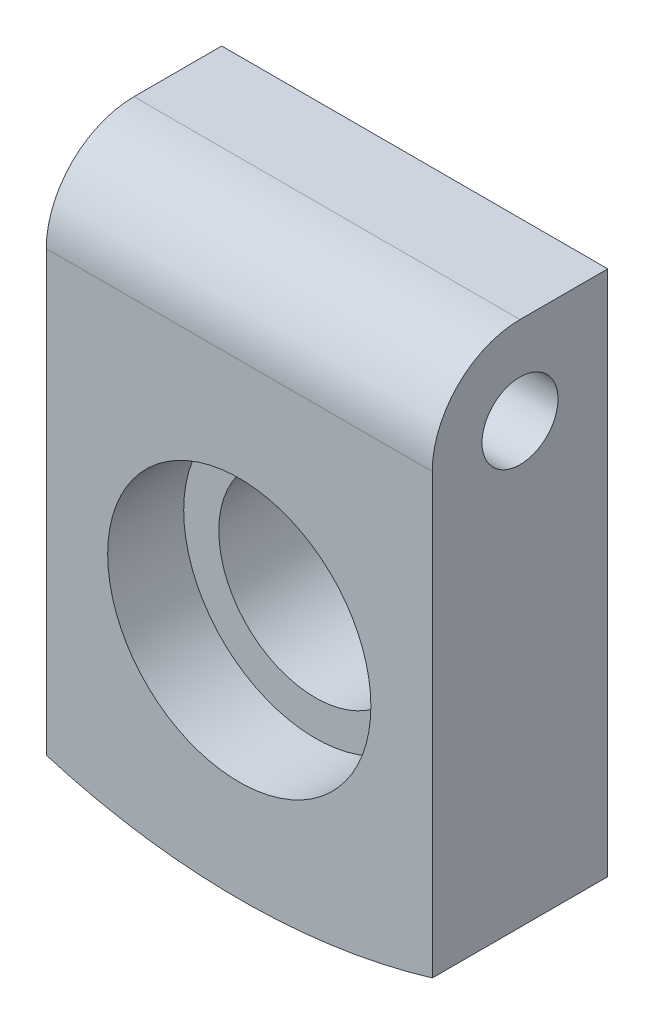
ISO-10303-21;
HEADER;
FILE_DESCRIPTION(('STEP AP214'),'2;1');
FILE_NAME('part.step','',(''),(''),'','','');
FILE_SCHEMA(('AUTOMOTIVE_DESIGN { 1 0 10303 214 1 1 1 1 }'));
ENDSEC;
DATA;
#1=APPLICATION_CONTEXT('core data for automotive mechanical design processes');
#2=APPLICATION_PROTOCOL_DEFINITION('international standard','automotive_design',2000,#1);
#3=PRODUCT_CONTEXT('',#1,'mechanical');
#4=PRODUCT('Part','Part','',(#3));
#5=PRODUCT_RELATED_PRODUCT_CATEGORY('part','',(#4));
#6=PRODUCT_DEFINITION_FORMATION('','',#4);
#7=PRODUCT_DEFINITION_CONTEXT('part definition',#1,'design');
#8=PRODUCT_DEFINITION('design','',#6,#7);
#9=PRODUCT_DEFINITION_SHAPE('','',#8);
#10=(LENGTH_UNIT() NAMED_UNIT(*) SI_UNIT(.MILLI.,.METRE.));
#11=(NAMED_UNIT(*) PLANE_ANGLE_UNIT() SI_UNIT($,.RADIAN.));
#12=(NAMED_UNIT(*) SI_UNIT($,.STERADIAN.) SOLID_ANGLE_UNIT());
#13=UNCERTAINTY_MEASURE_WITH_UNIT(LENGTH_MEASURE(1.E-05),#10,'distance_accuracy_value','');
#14=(GEOMETRIC_REPRESENTATION_CONTEXT(3) GLOBAL_UNCERTAINTY_ASSIGNED_CONTEXT((#13)) GLOBAL_UNIT_ASSIGNED_CONTEXT((#10,
#11,#12)) REPRESENTATION_CONTEXT('',''));
#15=CARTESIAN_POINT('',(0.,0.,0.));
#16=DIRECTION('',(0.,0.,1.));
#17=DIRECTION('',(1.,0.,0.));
#18=AXIS2_PLACEMENT_3D('',#15,#16,#17);
#19=CARTESIAN_POINT('',(33.,110.163514831363,30.));
#20=DIRECTION('',(0.,0.,-1.));
#21=DIRECTION('',(-1.,0.,0.));
#22=AXIS2_PLACEMENT_3D('',#19,#20,#21);
#23=CYLINDRICAL_SURFACE('',#22,115.);
#24=CARTESIAN_POINT('',(33.,110.163514831363,0.));
#25=DIRECTION('',(0.,0.,1.));
#26=DIRECTION('',(1.,0.,0.));
#27=AXIS2_PLACEMENT_3D('',#24,#25,#26);
#28=CIRCLE('',#27,115.);
#29=CARTESIAN_POINT('',(0.,0.,0.));
#30=VERTEX_POINT('',#29);
#31=CARTESIAN_POINT('',(66.,0.,0.));
#32=VERTEX_POINT('',#31);
#33=EDGE_CURVE('E104',#30,#32,#28,.T.);
#34=ORIENTED_EDGE('',*,*,#33,.T.);
#35=DIRECTION('',(0.,0.,-1.));
#36=VECTOR('',#35,1.);
#37=CARTESIAN_POINT('',(66.,0.,30.));
#38=LINE('',#37,#36);
#39=CARTESIAN_POINT('',(66.,0.,30.));
#40=VERTEX_POINT('',#39);
#41=EDGE_CURVE('E87',#40,#32,#38,.T.);
#42=ORIENTED_EDGE('',*,*,#41,.F.);
#43=CARTESIAN_POINT('',(33.,110.163514831363,30.));
#44=DIRECTION('',(0.,0.,1.));
#45=DIRECTION('',(1.,0.,0.));
#46=AXIS2_PLACEMENT_3D('',#43,#44,#45);
#47=CIRCLE('',#46,115.);
#48=CARTESIAN_POINT('',(0.,0.,30.));
#49=VERTEX_POINT('',#48);
#50=EDGE_CURVE('E94',#49,#40,#47,.T.);
#51=ORIENTED_EDGE('',*,*,#50,.F.);
#52=DIRECTION('',(0.,0.,-1.));
#53=VECTOR('',#52,1.);
#54=CARTESIAN_POINT('',(0.,0.,30.));
#55=LINE('',#54,#53);
#56=EDGE_CURVE('E114',#49,#30,#55,.T.);
#57=ORIENTED_EDGE('',*,*,#56,.T.);
#58=EDGE_LOOP('',(#34,#42,#51,#57));
#59=FACE_BOUND('',#58,.T.);
#60=ADVANCED_FACE('F37',(#59),#23,.T.);
#61=CARTESIAN_POINT('',(66.,90.,30.));
#62=DIRECTION('',(-1.,0.,0.));
#63=DIRECTION('',(0.,-1.,0.));
#64=AXIS2_PLACEMENT_3D('',#61,#62,#63);
#65=PLANE('',#64);
#66=CARTESIAN_POINT('',(66.,75.,15.));
#67=DIRECTION('',(-1.,0.,0.));
#68=DIRECTION('',(0.,-1.,0.));
#69=AXIS2_PLACEMENT_3D('',#66,#67,#68);
#70=CIRCLE('',#69,6.5);
#71=CARTESIAN_POINT('',(66.,68.5,15.));
#72=VERTEX_POINT('',#71);
#73=EDGE_CURVE('E134',#72,#72,#70,.F.);
#74=ORIENTED_EDGE('',*,*,#73,.F.);
#75=EDGE_LOOP('',(#74));
#76=FACE_BOUND('',#75,.T.);
#77=DIRECTION('',(0.,0.,-1.));
#78=VECTOR('',#77,1.);
#79=CARTESIAN_POINT('',(66.,90.,30.));
#80=LINE('',#79,#78);
#81=CARTESIAN_POINT('',(66.,90.,15.));
#82=VERTEX_POINT('',#81);
#83=CARTESIAN_POINT('',(66.,90.,0.));
#84=VERTEX_POINT('',#83);
#85=EDGE_CURVE('E106',#82,#84,#80,.T.);
#86=ORIENTED_EDGE('',*,*,#85,.F.);
#87=CARTESIAN_POINT('',(66.,75.,15.));
#88=DIRECTION('',(-1.,0.,0.));
#89=DIRECTION('',(0.,-1.,0.));
#90=AXIS2_PLACEMENT_3D('',#87,#88,#89);
#91=CIRCLE('',#90,15.);
#92=CARTESIAN_POINT('',(66.,75.,30.));
#93=VERTEX_POINT('',#92);
#94=EDGE_CURVE('E11',#82,#93,#91,.F.);
#95=ORIENTED_EDGE('',*,*,#94,.T.);
#96=DIRECTION('',(0.,1.,0.));
#97=VECTOR('',#96,1.);
#98=CARTESIAN_POINT('',(66.,90.,30.));
#99=LINE('',#98,#97);
#100=EDGE_CURVE('E82',#40,#93,#99,.T.);
#101=ORIENTED_EDGE('',*,*,#100,.F.);
#102=ORIENTED_EDGE('',*,*,#41,.T.);
#103=DIRECTION('',(0.,1.,0.));
#104=VECTOR('',#103,1.);
#105=CARTESIAN_POINT('',(66.,90.,0.));
#106=LINE('',#105,#104);
#107=EDGE_CURVE('E120',#32,#84,#106,.T.);
#108=ORIENTED_EDGE('',*,*,#107,.T.);
#109=EDGE_LOOP('',(#86,#95,#101,#102,#108));
#110=FACE_BOUND('',#109,.T.);
#111=ADVANCED_FACE('F84',(#76,#110),#65,.F.);
#112=CARTESIAN_POINT('',(0.,90.,30.));
#113=DIRECTION('',(0.,-1.,0.));
#114=DIRECTION('',(0.,0.,-1.));
#115=AXIS2_PLACEMENT_3D('',#112,#113,#114);
#116=PLANE('',#115);
#117=DIRECTION('',(0.,0.,-1.));
#118=VECTOR('',#117,1.);
#119=CARTESIAN_POINT('',(0.,90.,30.));
#120=LINE('',#119,#118);
#121=CARTESIAN_POINT('',(0.,90.,15.));
#122=VERTEX_POINT('',#121);
#123=CARTESIAN_POINT('',(0.,90.,0.));
#124=VERTEX_POINT('',#123);
#125=EDGE_CURVE('E109',#122,#124,#120,.T.);
#126=ORIENTED_EDGE('',*,*,#125,.F.);
#127=DIRECTION('',(-1.,0.,0.));
#128=VECTOR('',#127,1.);
#129=CARTESIAN_POINT('',(66.,90.,15.));
#130=LINE('',#129,#128);
#131=EDGE_CURVE('E45',#122,#82,#130,.F.);
#132=ORIENTED_EDGE('',*,*,#131,.T.);
#133=ORIENTED_EDGE('',*,*,#85,.T.);
#134=DIRECTION('',(-1.,0.,0.));
#135=VECTOR('',#134,1.);
#136=CARTESIAN_POINT('',(0.,90.,0.));
#137=LINE('',#136,#135);
#138=EDGE_CURVE('E117',#84,#124,#137,.T.);
#139=ORIENTED_EDGE('',*,*,#138,.T.);
#140=EDGE_LOOP('',(#126,#132,#133,#139));
#141=FACE_BOUND('',#140,.T.);
#142=ADVANCED_FACE('F148',(#141),#116,.F.);
#143=CARTESIAN_POINT('',(0.,0.,30.));
#144=DIRECTION('',(1.,0.,0.));
#145=DIRECTION('',(0.,0.,-1.));
#146=AXIS2_PLACEMENT_3D('',#143,#144,#145);
#147=PLANE('',#146);
#148=CARTESIAN_POINT('',(0.,75.,15.));
#149=DIRECTION('',(-1.,0.,0.));
#150=DIRECTION('',(0.,0.,1.));
#151=AXIS2_PLACEMENT_3D('',#148,#149,#150);
#152=CIRCLE('',#151,6.5);
#153=CARTESIAN_POINT('',(0.,75.,21.5));
#154=VERTEX_POINT('',#153);
#155=EDGE_CURVE('E139',#154,#154,#152,.T.);
#156=ORIENTED_EDGE('',*,*,#155,.F.);
#157=EDGE_LOOP('',(#156));
#158=FACE_BOUND('',#157,.T.);
#159=DIRECTION('',(0.,-1.,0.));
#160=VECTOR('',#159,1.);
#161=CARTESIAN_POINT('',(0.,0.,30.));
#162=LINE('',#161,#160);
#163=CARTESIAN_POINT('',(0.,75.,30.));
#164=VERTEX_POINT('',#163);
#165=EDGE_CURVE('E93',#164,#49,#162,.T.);
#166=ORIENTED_EDGE('',*,*,#165,.F.);
#167=CARTESIAN_POINT('',(0.,75.,15.));
#168=DIRECTION('',(1.,0.,0.));
#169=DIRECTION('',(0.,0.,-1.));
#170=AXIS2_PLACEMENT_3D('',#167,#168,#169);
#171=CIRCLE('',#170,15.);
#172=EDGE_CURVE('E59',#164,#122,#171,.F.);
#173=ORIENTED_EDGE('',*,*,#172,.T.);
#174=ORIENTED_EDGE('',*,*,#125,.T.);
#175=DIRECTION('',(0.,-1.,0.));
#176=VECTOR('',#175,1.);
#177=CARTESIAN_POINT('',(0.,0.,0.));
#178=LINE('',#177,#176);
#179=EDGE_CURVE('E101',#124,#30,#178,.T.);
#180=ORIENTED_EDGE('',*,*,#179,.T.);
#181=ORIENTED_EDGE('',*,*,#56,.F.);
#182=EDGE_LOOP('',(#166,#173,#174,#180,#181));
#183=FACE_BOUND('',#182,.T.);
#184=ADVANCED_FACE('F146',(#158,#183),#147,.F.);
#185=CARTESIAN_POINT('',(33.,110.163514831363,30.));
#186=DIRECTION('',(0.,0.,1.));
#187=DIRECTION('',(1.,0.,0.));
#188=AXIS2_PLACEMENT_3D('',#185,#186,#187);
#189=PLANE('',#188);
#190=CARTESIAN_POINT('',(33.,35.,30.));
#191=DIRECTION('',(0.,0.,1.));
#192=DIRECTION('',(1.,0.,0.));
#193=AXIS2_PLACEMENT_3D('',#190,#191,#192);
#194=CIRCLE('',#193,22.5);
#195=CARTESIAN_POINT('',(55.5,35.,30.));
#196=VERTEX_POINT('',#195);
#197=EDGE_CURVE('E131',#196,#196,#194,.F.);
#198=ORIENTED_EDGE('',*,*,#197,.T.);
#199=EDGE_LOOP('',(#198));
#200=FACE_BOUND('',#199,.T.);
#201=ORIENTED_EDGE('',*,*,#100,.T.);
#202=DIRECTION('',(-1.,0.,0.));
#203=VECTOR('',#202,1.);
#204=CARTESIAN_POINT('',(0.,75.,30.));
#205=LINE('',#204,#203);
#206=EDGE_CURVE('E105',#93,#164,#205,.T.);
#207=ORIENTED_EDGE('',*,*,#206,.T.);
#208=ORIENTED_EDGE('',*,*,#165,.T.);
#209=ORIENTED_EDGE('',*,*,#50,.T.);
#210=EDGE_LOOP('',(#201,#207,#208,#209));
#211=FACE_BOUND('',#210,.T.);
#212=ADVANCED_FACE('F97',(#200,#211),#189,.T.);
#213=CARTESIAN_POINT('',(33.,110.163514831363,0.));
#214=DIRECTION('',(0.,0.,1.));
#215=DIRECTION('',(1.,0.,0.));
#216=AXIS2_PLACEMENT_3D('',#213,#214,#215);
#217=PLANE('',#216);
#218=CARTESIAN_POINT('',(33.,35.,0.));
#219=DIRECTION('',(0.,0.,-1.));
#220=DIRECTION('',(-1.,0.,0.));
#221=AXIS2_PLACEMENT_3D('',#218,#219,#220);
#222=CIRCLE('',#221,16.5);
#223=CARTESIAN_POINT('',(16.5,35.,0.));
#224=VERTEX_POINT('',#223);
#225=EDGE_CURVE('E123',#224,#224,#222,.T.);
#226=ORIENTED_EDGE('',*,*,#225,.F.);
#227=EDGE_LOOP('',(#226));
#228=FACE_BOUND('',#227,.T.);
#229=ORIENTED_EDGE('',*,*,#33,.F.);
#230=ORIENTED_EDGE('',*,*,#179,.F.);
#231=ORIENTED_EDGE('',*,*,#138,.F.);
#232=ORIENTED_EDGE('',*,*,#107,.F.);
#233=EDGE_LOOP('',(#229,#230,#231,#232));
#234=FACE_BOUND('',#233,.T.);
#235=ADVANCED_FACE('F152',(#228,#234),#217,.F.);
#236=CARTESIAN_POINT('',(33.,35.,17.));
#237=DIRECTION('',(0.,0.,-1.));
#238=DIRECTION('',(-1.,0.,0.));
#239=AXIS2_PLACEMENT_3D('',#236,#237,#238);
#240=CYLINDRICAL_SURFACE('',#239,16.5);
#241=CARTESIAN_POINT('',(33.,35.,17.));
#242=DIRECTION('',(0.,0.,-1.));
#243=DIRECTION('',(-1.,0.,0.));
#244=AXIS2_PLACEMENT_3D('',#241,#242,#243);
#245=CIRCLE('',#244,16.5);
#246=CARTESIAN_POINT('',(16.5,35.,17.));
#247=VERTEX_POINT('',#246);
#248=EDGE_CURVE('E127',#247,#247,#245,.T.);
#249=ORIENTED_EDGE('',*,*,#248,.F.);
#250=EDGE_LOOP('',(#249));
#251=FACE_BOUND('',#250,.T.);
#252=ORIENTED_EDGE('',*,*,#225,.T.);
#253=EDGE_LOOP('',(#252));
#254=FACE_BOUND('',#253,.T.);
#255=ADVANCED_FACE('F176',(#251,#254),#240,.F.);
#256=CARTESIAN_POINT('',(33.,35.,30.001));
#257=DIRECTION('',(0.,0.,-1.));
#258=DIRECTION('',(-1.,0.,0.));
#259=AXIS2_PLACEMENT_3D('',#256,#257,#258);
#260=CYLINDRICAL_SURFACE('',#259,22.5);
#261=ORIENTED_EDGE('',*,*,#197,.F.);
#262=EDGE_LOOP('',(#261));
#263=FACE_BOUND('',#262,.T.);
#264=CARTESIAN_POINT('',(33.,35.,17.));
#265=DIRECTION('',(0.,0.,-1.));
#266=DIRECTION('',(-1.,0.,0.));
#267=AXIS2_PLACEMENT_3D('',#264,#265,#266);
#268=CIRCLE('',#267,22.5);
#269=CARTESIAN_POINT('',(10.5,35.,17.));
#270=VERTEX_POINT('',#269);
#271=EDGE_CURVE('E130',#270,#270,#268,.T.);
#272=ORIENTED_EDGE('',*,*,#271,.T.);
#273=EDGE_LOOP('',(#272));
#274=FACE_BOUND('',#273,.T.);
#275=ADVANCED_FACE('F162',(#263,#274),#260,.F.);
#276=CARTESIAN_POINT('',(33.,35.,17.));
#277=DIRECTION('',(0.,0.,-1.));
#278=DIRECTION('',(-1.,0.,0.));
#279=AXIS2_PLACEMENT_3D('',#276,#277,#278);
#280=PLANE('',#279);
#281=ORIENTED_EDGE('',*,*,#248,.T.);
#282=EDGE_LOOP('',(#281));
#283=FACE_BOUND('',#282,.T.);
#284=ORIENTED_EDGE('',*,*,#271,.F.);
#285=EDGE_LOOP('',(#284));
#286=FACE_BOUND('',#285,.T.);
#287=ADVANCED_FACE('F156',(#283,#286),#280,.F.);
#288=CARTESIAN_POINT('',(33.,75.,15.));
#289=DIRECTION('',(1.,0.,0.));
#290=DIRECTION('',(0.,0.,-1.));
#291=AXIS2_PLACEMENT_3D('',#288,#289,#290);
#292=CYLINDRICAL_SURFACE('',#291,15.);
#293=ORIENTED_EDGE('',*,*,#94,.F.);
#294=ORIENTED_EDGE('',*,*,#131,.F.);
#295=ORIENTED_EDGE('',*,*,#172,.F.);
#296=ORIENTED_EDGE('',*,*,#206,.F.);
#297=EDGE_LOOP('',(#293,#294,#295,#296));
#298=FACE_BOUND('',#297,.T.);
#299=ADVANCED_FACE('F39',(#298),#292,.T.);
#300=CARTESIAN_POINT('',(66.001,75.,15.));
#301=DIRECTION('',(-1.,0.,0.));
#302=DIRECTION('',(0.,0.,1.));
#303=AXIS2_PLACEMENT_3D('',#300,#301,#302);
#304=CYLINDRICAL_SURFACE('',#303,6.5);
#305=ORIENTED_EDGE('',*,*,#155,.T.);
#306=EDGE_LOOP('',(#305));
#307=FACE_BOUND('',#306,.T.);
#308=ORIENTED_EDGE('',*,*,#73,.T.);
#309=EDGE_LOOP('',(#308));
#310=FACE_BOUND('',#309,.T.);
#311=ADVANCED_FACE('F143',(#307,#310),#304,.F.);
#312=CLOSED_SHELL('',(#60,#111,#142,#184,#212,#235,#255,#275,#287,#299,#311));
#313=MANIFOLD_SOLID_BREP('B2',#312);
#314=ADVANCED_BREP_SHAPE_REPRESENTATION('',(#18,#313),#14);
#315=SHAPE_DEFINITION_REPRESENTATION(#9,#314);
ENDSEC;
END-ISO-10303-21;
